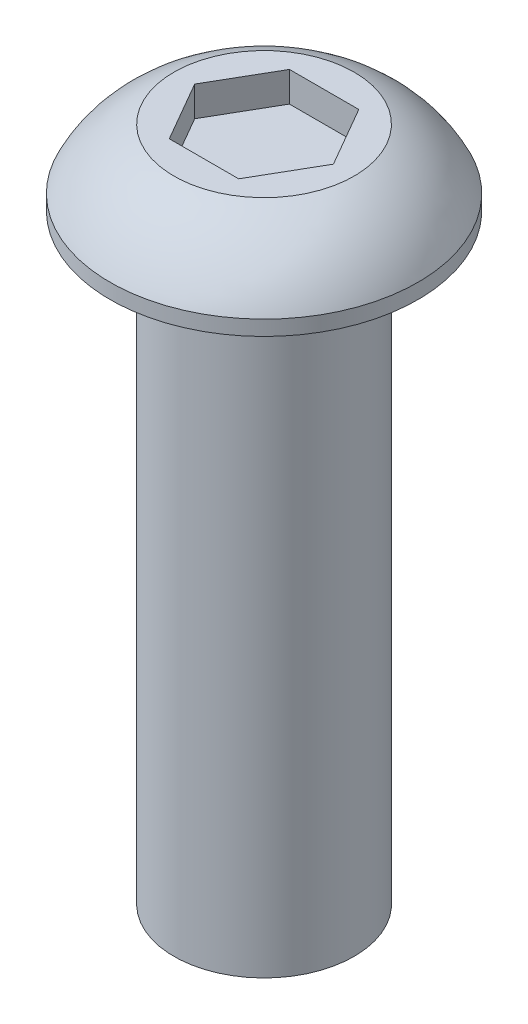
ISO-10303-21;
HEADER;
FILE_DESCRIPTION(('STEP AP214'),'2;1');
FILE_NAME('part.step','',(''),(''),'','','');
FILE_SCHEMA(('AUTOMOTIVE_DESIGN { 1 0 10303 214 1 1 1 1 }'));
ENDSEC;
DATA;
#1=APPLICATION_CONTEXT('core data for automotive mechanical design processes');
#2=APPLICATION_PROTOCOL_DEFINITION('international standard','automotive_design',2000,#1);
#3=PRODUCT_CONTEXT('',#1,'mechanical');
#4=PRODUCT('Part','Part','',(#3));
#5=PRODUCT_RELATED_PRODUCT_CATEGORY('part','',(#4));
#6=PRODUCT_DEFINITION_FORMATION('','',#4);
#7=PRODUCT_DEFINITION_CONTEXT('part definition',#1,'design');
#8=PRODUCT_DEFINITION('design','',#6,#7);
#9=PRODUCT_DEFINITION_SHAPE('','',#8);
#10=(LENGTH_UNIT() NAMED_UNIT(*) SI_UNIT(.MILLI.,.METRE.));
#11=(NAMED_UNIT(*) PLANE_ANGLE_UNIT() SI_UNIT($,.RADIAN.));
#12=(NAMED_UNIT(*) SI_UNIT($,.STERADIAN.) SOLID_ANGLE_UNIT());
#13=UNCERTAINTY_MEASURE_WITH_UNIT(LENGTH_MEASURE(1.E-05),#10,'distance_accuracy_value','');
#14=(GEOMETRIC_REPRESENTATION_CONTEXT(3) GLOBAL_UNCERTAINTY_ASSIGNED_CONTEXT((#13)) GLOBAL_UNIT_ASSIGNED_CONTEXT((#10,
#11,#12)) REPRESENTATION_CONTEXT('',''));
#15=CARTESIAN_POINT('',(0.,0.,0.));
#16=DIRECTION('',(0.,0.,1.));
#17=DIRECTION('',(1.,0.,0.));
#18=AXIS2_PLACEMENT_3D('',#15,#16,#17);
#19=CARTESIAN_POINT('',(0.,-20.,0.));
#20=DIRECTION('',(0.,-1.,0.));
#21=DIRECTION('',(0.,0.,-1.));
#22=AXIS2_PLACEMENT_3D('',#19,#20,#21);
#23=CYLINDRICAL_SURFACE('',#22,3.);
#24=CARTESIAN_POINT('',(0.,0.,0.));
#25=DIRECTION('',(0.,-1.,0.));
#26=DIRECTION('',(0.,0.,-1.));
#27=AXIS2_PLACEMENT_3D('',#24,#25,#26);
#28=CIRCLE('',#27,3.);
#29=CARTESIAN_POINT('',(0.,0.,-3.));
#30=VERTEX_POINT('',#29);
#31=EDGE_CURVE('E11',#30,#30,#28,.T.);
#32=ORIENTED_EDGE('',*,*,#31,.T.);
#33=EDGE_LOOP('',(#32));
#34=FACE_BOUND('',#33,.T.);
#35=CARTESIAN_POINT('',(0.,-20.,0.));
#36=DIRECTION('',(0.,-1.,0.));
#37=DIRECTION('',(0.,0.,-1.));
#38=AXIS2_PLACEMENT_3D('',#35,#36,#37);
#39=CIRCLE('',#38,3.);
#40=CARTESIAN_POINT('',(0.,-20.,-3.));
#41=VERTEX_POINT('',#40);
#42=EDGE_CURVE('E136',#41,#41,#39,.T.);
#43=ORIENTED_EDGE('',*,*,#42,.F.);
#44=EDGE_LOOP('',(#43));
#45=FACE_BOUND('',#44,.T.);
#46=ADVANCED_FACE('F35',(#34,#45),#23,.T.);
#47=CARTESIAN_POINT('',(3.,0.,0.));
#48=DIRECTION('',(0.,-1.,0.));
#49=DIRECTION('',(0.,0.,-1.));
#50=AXIS2_PLACEMENT_3D('',#47,#48,#49);
#51=PLANE('',#50);
#52=CARTESIAN_POINT('',(0.,0.,0.));
#53=DIRECTION('',(0.,-1.,0.));
#54=DIRECTION('',(0.,0.,-1.));
#55=AXIS2_PLACEMENT_3D('',#52,#53,#54);
#56=CIRCLE('',#55,5.125);
#57=CARTESIAN_POINT('',(0.,0.,-5.125));
#58=VERTEX_POINT('',#57);
#59=EDGE_CURVE('E42',#58,#58,#56,.T.);
#60=ORIENTED_EDGE('',*,*,#59,.T.);
#61=EDGE_LOOP('',(#60));
#62=FACE_BOUND('',#61,.T.);
#63=ORIENTED_EDGE('',*,*,#31,.F.);
#64=EDGE_LOOP('',(#63));
#65=FACE_BOUND('',#64,.T.);
#66=ADVANCED_FACE('F152',(#62,#65),#51,.T.);
#67=CARTESIAN_POINT('',(0.,-20.,0.));
#68=DIRECTION('',(0.,-1.,0.));
#69=DIRECTION('',(0.,0.,-1.));
#70=AXIS2_PLACEMENT_3D('',#67,#68,#69);
#71=CYLINDRICAL_SURFACE('',#70,5.125);
#72=CARTESIAN_POINT('',(0.,0.5,0.));
#73=DIRECTION('',(0.,-1.,0.));
#74=DIRECTION('',(0.,0.,-1.));
#75=AXIS2_PLACEMENT_3D('',#72,#73,#74);
#76=CIRCLE('',#75,5.125);
#77=CARTESIAN_POINT('',(0.,0.5,-5.125));
#78=VERTEX_POINT('',#77);
#79=EDGE_CURVE('E147',#78,#78,#76,.T.);
#80=ORIENTED_EDGE('',*,*,#79,.T.);
#81=EDGE_LOOP('',(#80));
#82=FACE_BOUND('',#81,.T.);
#83=ORIENTED_EDGE('',*,*,#59,.F.);
#84=EDGE_LOOP('',(#83));
#85=FACE_BOUND('',#84,.T.);
#86=ADVANCED_FACE('F155',(#82,#85),#71,.T.);
#87=CARTESIAN_POINT('',(0.,-1.21210202974091,0.));
#88=DIRECTION('',(0.,-1.,0.));
#89=DIRECTION('',(0.,0.,-1.));
#90=AXIS2_PLACEMENT_3D('',#87,#88,#89);
#91=DEGENERATE_TOROIDAL_SURFACE('',#90,1.50993338377326,4.,.T.);
#92=CARTESIAN_POINT('',(0.,2.5,0.));
#93=DIRECTION('',(0.,-1.,0.));
#94=DIRECTION('',(0.,0.,-1.));
#95=AXIS2_PLACEMENT_3D('',#92,#93,#94);
#96=CIRCLE('',#95,3.);
#97=CARTESIAN_POINT('',(0.,2.5,-3.));
#98=VERTEX_POINT('',#97);
#99=EDGE_CURVE('E144',#98,#98,#96,.T.);
#100=ORIENTED_EDGE('',*,*,#99,.T.);
#101=EDGE_LOOP('',(#100));
#102=FACE_BOUND('',#101,.T.);
#103=ORIENTED_EDGE('',*,*,#79,.F.);
#104=EDGE_LOOP('',(#103));
#105=FACE_BOUND('',#104,.T.);
#106=ADVANCED_FACE('F157',(#102,#105),#91,.T.);
#107=CARTESIAN_POINT('',(3.,2.5,0.));
#108=DIRECTION('',(0.,1.,0.));
#109=DIRECTION('',(0.,0.,1.));
#110=AXIS2_PLACEMENT_3D('',#107,#108,#109);
#111=PLANE('',#110);
#112=DIRECTION('',(-0.5,0.,-0.866025403784438));
#113=VECTOR('',#112,1.);
#114=CARTESIAN_POINT('',(2.3094010767585,2.5,0.));
#115=LINE('',#114,#113);
#116=CARTESIAN_POINT('',(2.3094010767585,2.5,0.));
#117=VERTEX_POINT('',#116);
#118=CARTESIAN_POINT('',(1.15470053837925,2.5,-2.));
#119=VERTEX_POINT('',#118);
#120=EDGE_CURVE('E49',#117,#119,#115,.T.);
#121=ORIENTED_EDGE('',*,*,#120,.F.);
#122=DIRECTION('',(0.5,0.,-0.866025403784439));
#123=VECTOR('',#122,1.);
#124=CARTESIAN_POINT('',(1.15470053837925,2.5,2.));
#125=LINE('',#124,#123);
#126=CARTESIAN_POINT('',(1.15470053837925,2.5,2.));
#127=VERTEX_POINT('',#126);
#128=EDGE_CURVE('E132',#127,#117,#125,.T.);
#129=ORIENTED_EDGE('',*,*,#128,.F.);
#130=DIRECTION('',(1.,0.,0.));
#131=VECTOR('',#130,1.);
#132=CARTESIAN_POINT('',(-1.15470053837925,2.5,2.));
#133=LINE('',#132,#131);
#134=CARTESIAN_POINT('',(-1.15470053837925,2.5,2.));
#135=VERTEX_POINT('',#134);
#136=EDGE_CURVE('E130',#135,#127,#133,.T.);
#137=ORIENTED_EDGE('',*,*,#136,.F.);
#138=DIRECTION('',(0.5,0.,0.866025403784439));
#139=VECTOR('',#138,1.);
#140=CARTESIAN_POINT('',(-2.3094010767585,2.5,0.));
#141=LINE('',#140,#139);
#142=CARTESIAN_POINT('',(-2.3094010767585,2.5,0.));
#143=VERTEX_POINT('',#142);
#144=EDGE_CURVE('E97',#143,#135,#141,.T.);
#145=ORIENTED_EDGE('',*,*,#144,.F.);
#146=DIRECTION('',(-0.499999999999999,0.,0.866025403784439));
#147=VECTOR('',#146,1.);
#148=CARTESIAN_POINT('',(-1.15470053837925,2.5,-2.));
#149=LINE('',#148,#147);
#150=CARTESIAN_POINT('',(-1.15470053837925,2.5,-2.));
#151=VERTEX_POINT('',#150);
#152=EDGE_CURVE('E126',#151,#143,#149,.T.);
#153=ORIENTED_EDGE('',*,*,#152,.F.);
#154=DIRECTION('',(-1.,0.,0.));
#155=VECTOR('',#154,1.);
#156=CARTESIAN_POINT('',(1.15470053837925,2.5,-2.));
#157=LINE('',#156,#155);
#158=EDGE_CURVE('E123',#119,#151,#157,.T.);
#159=ORIENTED_EDGE('',*,*,#158,.F.);
#160=EDGE_LOOP('',(#121,#129,#137,#145,#153,#159));
#161=FACE_BOUND('',#160,.T.);
#162=ORIENTED_EDGE('',*,*,#99,.F.);
#163=EDGE_LOOP('',(#162));
#164=FACE_BOUND('',#163,.T.);
#165=ADVANCED_FACE('F164',(#161,#164),#111,.T.);
#166=CARTESIAN_POINT('',(3.,-20.,0.));
#167=DIRECTION('',(0.,-1.,0.));
#168=DIRECTION('',(0.,0.,-1.));
#169=AXIS2_PLACEMENT_3D('',#166,#167,#168);
#170=PLANE('',#169);
#171=ORIENTED_EDGE('',*,*,#42,.T.);
#172=EDGE_LOOP('',(#171));
#173=FACE_BOUND('',#172,.T.);
#174=ADVANCED_FACE('F175',(#173),#170,.T.);
#175=CARTESIAN_POINT('',(2.3094010767585,1.5,0.));
#176=DIRECTION('',(0.866025403784439,0.,-0.5));
#177=DIRECTION('',(-0.5,0.,-0.866025403784439));
#178=AXIS2_PLACEMENT_3D('',#175,#176,#177);
#179=PLANE('',#178);
#180=ORIENTED_EDGE('',*,*,#120,.T.);
#181=DIRECTION('',(0.,1.,0.));
#182=VECTOR('',#181,1.);
#183=CARTESIAN_POINT('',(1.15470053837925,1.5,-2.));
#184=LINE('',#183,#182);
#185=CARTESIAN_POINT('',(1.15470053837925,1.5,-2.));
#186=VERTEX_POINT('',#185);
#187=EDGE_CURVE('E79',#186,#119,#184,.T.);
#188=ORIENTED_EDGE('',*,*,#187,.F.);
#189=DIRECTION('',(-0.5,0.,-0.866025403784438));
#190=VECTOR('',#189,1.);
#191=CARTESIAN_POINT('',(2.3094010767585,1.5,0.));
#192=LINE('',#191,#190);
#193=CARTESIAN_POINT('',(2.3094010767585,1.5,0.));
#194=VERTEX_POINT('',#193);
#195=EDGE_CURVE('E134',#194,#186,#192,.T.);
#196=ORIENTED_EDGE('',*,*,#195,.F.);
#197=DIRECTION('',(0.,1.,0.));
#198=VECTOR('',#197,1.);
#199=CARTESIAN_POINT('',(2.3094010767585,1.5,0.));
#200=LINE('',#199,#198);
#201=EDGE_CURVE('E57',#194,#117,#200,.T.);
#202=ORIENTED_EDGE('',*,*,#201,.T.);
#203=EDGE_LOOP('',(#180,#188,#196,#202));
#204=FACE_BOUND('',#203,.T.);
#205=ADVANCED_FACE('F177',(#204),#179,.F.);
#206=CARTESIAN_POINT('',(1.15470053837925,1.5,2.));
#207=DIRECTION('',(0.866025403784439,0.,0.5));
#208=DIRECTION('',(0.5,0.,-0.866025403784439));
#209=AXIS2_PLACEMENT_3D('',#206,#207,#208);
#210=PLANE('',#209);
#211=ORIENTED_EDGE('',*,*,#128,.T.);
#212=ORIENTED_EDGE('',*,*,#201,.F.);
#213=DIRECTION('',(0.5,0.,-0.866025403784439));
#214=VECTOR('',#213,1.);
#215=CARTESIAN_POINT('',(1.15470053837925,1.5,2.));
#216=LINE('',#215,#214);
#217=CARTESIAN_POINT('',(1.15470053837925,1.5,2.));
#218=VERTEX_POINT('',#217);
#219=EDGE_CURVE('E109',#218,#194,#216,.T.);
#220=ORIENTED_EDGE('',*,*,#219,.F.);
#221=DIRECTION('',(0.,1.,0.));
#222=VECTOR('',#221,1.);
#223=CARTESIAN_POINT('',(1.15470053837925,1.5,2.));
#224=LINE('',#223,#222);
#225=EDGE_CURVE('E101',#218,#127,#224,.T.);
#226=ORIENTED_EDGE('',*,*,#225,.T.);
#227=EDGE_LOOP('',(#211,#212,#220,#226));
#228=FACE_BOUND('',#227,.T.);
#229=ADVANCED_FACE('F183',(#228),#210,.F.);
#230=CARTESIAN_POINT('',(-1.15470053837925,1.5,2.));
#231=DIRECTION('',(0.,0.,1.));
#232=DIRECTION('',(1.,0.,0.));
#233=AXIS2_PLACEMENT_3D('',#230,#231,#232);
#234=PLANE('',#233);
#235=ORIENTED_EDGE('',*,*,#136,.T.);
#236=ORIENTED_EDGE('',*,*,#225,.F.);
#237=DIRECTION('',(1.,0.,0.));
#238=VECTOR('',#237,1.);
#239=CARTESIAN_POINT('',(-1.15470053837925,1.5,2.));
#240=LINE('',#239,#238);
#241=CARTESIAN_POINT('',(-1.15470053837925,1.5,2.));
#242=VERTEX_POINT('',#241);
#243=EDGE_CURVE('E105',#242,#218,#240,.T.);
#244=ORIENTED_EDGE('',*,*,#243,.F.);
#245=DIRECTION('',(0.,1.,0.));
#246=VECTOR('',#245,1.);
#247=CARTESIAN_POINT('',(-1.15470053837925,1.5,2.));
#248=LINE('',#247,#246);
#249=EDGE_CURVE('E90',#242,#135,#248,.T.);
#250=ORIENTED_EDGE('',*,*,#249,.T.);
#251=EDGE_LOOP('',(#235,#236,#244,#250));
#252=FACE_BOUND('',#251,.T.);
#253=ADVANCED_FACE('F106',(#252),#234,.F.);
#254=CARTESIAN_POINT('',(-2.3094010767585,1.5,0.));
#255=DIRECTION('',(-0.866025403784439,0.,0.5));
#256=DIRECTION('',(0.5,0.,0.866025403784439));
#257=AXIS2_PLACEMENT_3D('',#254,#255,#256);
#258=PLANE('',#257);
#259=ORIENTED_EDGE('',*,*,#144,.T.);
#260=ORIENTED_EDGE('',*,*,#249,.F.);
#261=DIRECTION('',(0.5,0.,0.866025403784439));
#262=VECTOR('',#261,1.);
#263=CARTESIAN_POINT('',(-2.3094010767585,1.5,0.));
#264=LINE('',#263,#262);
#265=CARTESIAN_POINT('',(-2.3094010767585,1.5,0.));
#266=VERTEX_POINT('',#265);
#267=EDGE_CURVE('E94',#266,#242,#264,.T.);
#268=ORIENTED_EDGE('',*,*,#267,.F.);
#269=DIRECTION('',(0.,1.,0.));
#270=VECTOR('',#269,1.);
#271=CARTESIAN_POINT('',(-2.3094010767585,1.5,0.));
#272=LINE('',#271,#270);
#273=EDGE_CURVE('E102',#266,#143,#272,.T.);
#274=ORIENTED_EDGE('',*,*,#273,.T.);
#275=EDGE_LOOP('',(#259,#260,#268,#274));
#276=FACE_BOUND('',#275,.T.);
#277=ADVANCED_FACE('F92',(#276),#258,.F.);
#278=CARTESIAN_POINT('',(-1.15470053837925,1.5,-2.));
#279=DIRECTION('',(-0.866025403784439,0.,-0.5));
#280=DIRECTION('',(-0.5,0.,0.866025403784439));
#281=AXIS2_PLACEMENT_3D('',#278,#279,#280);
#282=PLANE('',#281);
#283=ORIENTED_EDGE('',*,*,#152,.T.);
#284=ORIENTED_EDGE('',*,*,#273,.F.);
#285=DIRECTION('',(-0.499999999999999,0.,0.866025403784439));
#286=VECTOR('',#285,1.);
#287=CARTESIAN_POINT('',(-1.15470053837925,1.5,-2.));
#288=LINE('',#287,#286);
#289=CARTESIAN_POINT('',(-1.15470053837925,1.5,-2.));
#290=VERTEX_POINT('',#289);
#291=EDGE_CURVE('E115',#290,#266,#288,.T.);
#292=ORIENTED_EDGE('',*,*,#291,.F.);
#293=DIRECTION('',(0.,1.,0.));
#294=VECTOR('',#293,1.);
#295=CARTESIAN_POINT('',(-1.15470053837925,1.5,-2.));
#296=LINE('',#295,#294);
#297=EDGE_CURVE('E139',#290,#151,#296,.T.);
#298=ORIENTED_EDGE('',*,*,#297,.T.);
#299=EDGE_LOOP('',(#283,#284,#292,#298));
#300=FACE_BOUND('',#299,.T.);
#301=ADVANCED_FACE('F191',(#300),#282,.F.);
#302=CARTESIAN_POINT('',(1.15470053837925,1.5,-2.));
#303=DIRECTION('',(0.,0.,-1.));
#304=DIRECTION('',(-1.,0.,0.));
#305=AXIS2_PLACEMENT_3D('',#302,#303,#304);
#306=PLANE('',#305);
#307=ORIENTED_EDGE('',*,*,#158,.T.);
#308=ORIENTED_EDGE('',*,*,#297,.F.);
#309=DIRECTION('',(-1.,0.,0.));
#310=VECTOR('',#309,1.);
#311=CARTESIAN_POINT('',(1.15470053837925,1.5,-2.));
#312=LINE('',#311,#310);
#313=EDGE_CURVE('E117',#186,#290,#312,.T.);
#314=ORIENTED_EDGE('',*,*,#313,.F.);
#315=ORIENTED_EDGE('',*,*,#187,.T.);
#316=EDGE_LOOP('',(#307,#308,#314,#315));
#317=FACE_BOUND('',#316,.T.);
#318=ADVANCED_FACE('F188',(#317),#306,.F.);
#319=CARTESIAN_POINT('',(0.,1.5,0.));
#320=DIRECTION('',(0.,1.,0.));
#321=DIRECTION('',(0.,0.,1.));
#322=AXIS2_PLACEMENT_3D('',#319,#320,#321);
#323=PLANE('',#322);
#324=ORIENTED_EDGE('',*,*,#195,.T.);
#325=ORIENTED_EDGE('',*,*,#313,.T.);
#326=ORIENTED_EDGE('',*,*,#291,.T.);
#327=ORIENTED_EDGE('',*,*,#267,.T.);
#328=ORIENTED_EDGE('',*,*,#243,.T.);
#329=ORIENTED_EDGE('',*,*,#219,.T.);
#330=EDGE_LOOP('',(#324,#325,#326,#327,#328,#329));
#331=FACE_BOUND('',#330,.T.);
#332=ADVANCED_FACE('F112',(#331),#323,.T.);
#333=CLOSED_SHELL('',(#46,#66,#86,#106,#165,#174,#205,#229,#253,#277,#301,#318,#332));
#334=MANIFOLD_SOLID_BREP('B2',#333);
#335=ADVANCED_BREP_SHAPE_REPRESENTATION('',(#18,#334),#14);
#336=SHAPE_DEFINITION_REPRESENTATION(#9,#335);
ENDSEC;
END-ISO-10303-21;
